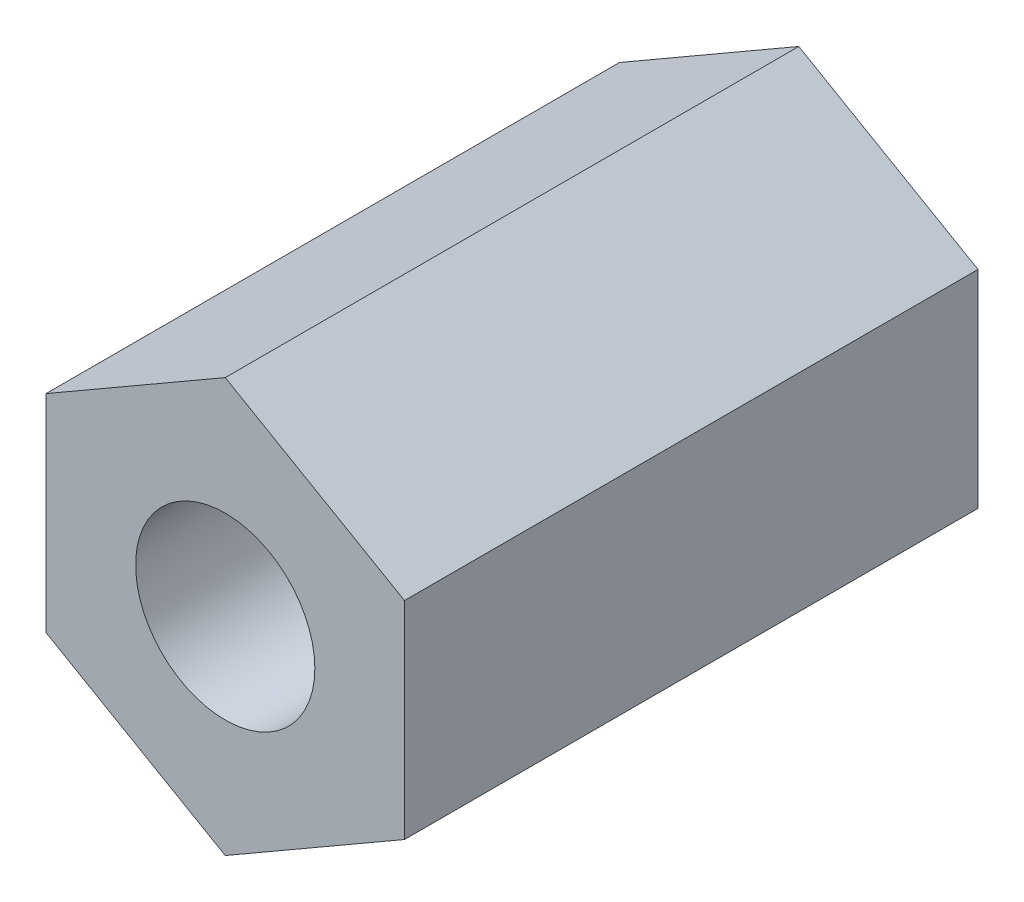
ISO-10303-21;
HEADER;
FILE_DESCRIPTION(('STEP AP214'),'2;1');
FILE_NAME('part.step','',(''),(''),'','','');
FILE_SCHEMA(('AUTOMOTIVE_DESIGN { 1 0 10303 214 1 1 1 1 }'));
ENDSEC;
DATA;
#1=APPLICATION_CONTEXT('core data for automotive mechanical design processes');
#2=APPLICATION_PROTOCOL_DEFINITION('international standard','automotive_design',2000,#1);
#3=PRODUCT_CONTEXT('',#1,'mechanical');
#4=PRODUCT('Part','Part','',(#3));
#5=PRODUCT_RELATED_PRODUCT_CATEGORY('part','',(#4));
#6=PRODUCT_DEFINITION_FORMATION('','',#4);
#7=PRODUCT_DEFINITION_CONTEXT('part definition',#1,'design');
#8=PRODUCT_DEFINITION('design','',#6,#7);
#9=PRODUCT_DEFINITION_SHAPE('','',#8);
#10=(LENGTH_UNIT() NAMED_UNIT(*) SI_UNIT(.MILLI.,.METRE.));
#11=(NAMED_UNIT(*) PLANE_ANGLE_UNIT() SI_UNIT($,.RADIAN.));
#12=(NAMED_UNIT(*) SI_UNIT($,.STERADIAN.) SOLID_ANGLE_UNIT());
#13=UNCERTAINTY_MEASURE_WITH_UNIT(LENGTH_MEASURE(1.E-05),#10,'distance_accuracy_value','');
#14=(GEOMETRIC_REPRESENTATION_CONTEXT(3) GLOBAL_UNCERTAINTY_ASSIGNED_CONTEXT((#13)) GLOBAL_UNIT_ASSIGNED_CONTEXT((#10,
#11,#12)) REPRESENTATION_CONTEXT('',''));
#15=CARTESIAN_POINT('',(0.,0.,0.));
#16=DIRECTION('',(0.,0.,1.));
#17=DIRECTION('',(1.,0.,0.));
#18=AXIS2_PLACEMENT_3D('',#15,#16,#17);
#19=CARTESIAN_POINT('',(0.,-2.88675134594813,8.));
#20=DIRECTION('',(-0.5,0.866025403784439,0.));
#21=DIRECTION('',(-0.866025403784439,-0.5,0.));
#22=AXIS2_PLACEMENT_3D('',#19,#20,#21);
#23=PLANE('',#22);
#24=DIRECTION('',(0.866025403784439,0.5,0.));
#25=VECTOR('',#24,1.);
#26=CARTESIAN_POINT('',(0.,-2.88675134594813,0.));
#27=LINE('',#26,#25);
#28=CARTESIAN_POINT('',(0.,-2.88675134594813,0.));
#29=VERTEX_POINT('',#28);
#30=CARTESIAN_POINT('',(2.5,-1.44337567297407,0.));
#31=VERTEX_POINT('',#30);
#32=EDGE_CURVE('E116',#29,#31,#27,.T.);
#33=ORIENTED_EDGE('',*,*,#32,.T.);
#34=DIRECTION('',(0.,0.,-1.));
#35=VECTOR('',#34,1.);
#36=CARTESIAN_POINT('',(2.5,-1.44337567297407,8.));
#37=LINE('',#36,#35);
#38=CARTESIAN_POINT('',(2.5,-1.44337567297407,8.));
#39=VERTEX_POINT('',#38);
#40=EDGE_CURVE('E11',#39,#31,#37,.T.);
#41=ORIENTED_EDGE('',*,*,#40,.F.);
#42=DIRECTION('',(0.866025403784439,0.5,0.));
#43=VECTOR('',#42,1.);
#44=CARTESIAN_POINT('',(0.,-2.88675134594813,8.));
#45=LINE('',#44,#43);
#46=CARTESIAN_POINT('',(0.,-2.88675134594813,8.));
#47=VERTEX_POINT('',#46);
#48=EDGE_CURVE('E127',#47,#39,#45,.T.);
#49=ORIENTED_EDGE('',*,*,#48,.F.);
#50=DIRECTION('',(0.,0.,-1.));
#51=VECTOR('',#50,1.);
#52=CARTESIAN_POINT('',(0.,-2.88675134594813,8.));
#53=LINE('',#52,#51);
#54=EDGE_CURVE('E112',#47,#29,#53,.T.);
#55=ORIENTED_EDGE('',*,*,#54,.T.);
#56=EDGE_LOOP('',(#33,#41,#49,#55));
#57=FACE_BOUND('',#56,.T.);
#58=ADVANCED_FACE('F32',(#57),#23,.F.);
#59=CARTESIAN_POINT('',(2.5,-1.44337567297407,8.));
#60=DIRECTION('',(-1.,0.,0.));
#61=DIRECTION('',(0.,-1.,0.));
#62=AXIS2_PLACEMENT_3D('',#59,#60,#61);
#63=PLANE('',#62);
#64=DIRECTION('',(0.,1.,0.));
#65=VECTOR('',#64,1.);
#66=CARTESIAN_POINT('',(2.5,-1.44337567297407,0.));
#67=LINE('',#66,#65);
#68=CARTESIAN_POINT('',(2.5,1.44337567297407,0.));
#69=VERTEX_POINT('',#68);
#70=EDGE_CURVE('E119',#31,#69,#67,.T.);
#71=ORIENTED_EDGE('',*,*,#70,.T.);
#72=DIRECTION('',(0.,0.,-1.));
#73=VECTOR('',#72,1.);
#74=CARTESIAN_POINT('',(2.5,1.44337567297407,8.));
#75=LINE('',#74,#73);
#76=CARTESIAN_POINT('',(2.5,1.44337567297407,8.));
#77=VERTEX_POINT('',#76);
#78=EDGE_CURVE('E40',#77,#69,#75,.T.);
#79=ORIENTED_EDGE('',*,*,#78,.F.);
#80=DIRECTION('',(0.,1.,0.));
#81=VECTOR('',#80,1.);
#82=CARTESIAN_POINT('',(2.5,-1.44337567297407,8.));
#83=LINE('',#82,#81);
#84=EDGE_CURVE('E85',#39,#77,#83,.T.);
#85=ORIENTED_EDGE('',*,*,#84,.F.);
#86=ORIENTED_EDGE('',*,*,#40,.T.);
#87=EDGE_LOOP('',(#71,#79,#85,#86));
#88=FACE_BOUND('',#87,.T.);
#89=ADVANCED_FACE('F152',(#88),#63,.F.);
#90=CARTESIAN_POINT('',(2.5,1.44337567297407,8.));
#91=DIRECTION('',(-0.5,-0.866025403784439,0.));
#92=DIRECTION('',(0.866025403784439,-0.5,0.));
#93=AXIS2_PLACEMENT_3D('',#90,#91,#92);
#94=PLANE('',#93);
#95=DIRECTION('',(-0.866025403784439,0.5,0.));
#96=VECTOR('',#95,1.);
#97=CARTESIAN_POINT('',(2.5,1.44337567297407,0.));
#98=LINE('',#97,#96);
#99=CARTESIAN_POINT('',(0.,2.88675134594813,0.));
#100=VERTEX_POINT('',#99);
#101=EDGE_CURVE('E122',#69,#100,#98,.T.);
#102=ORIENTED_EDGE('',*,*,#101,.T.);
#103=DIRECTION('',(0.,0.,-1.));
#104=VECTOR('',#103,1.);
#105=CARTESIAN_POINT('',(0.,2.88675134594813,8.));
#106=LINE('',#105,#104);
#107=CARTESIAN_POINT('',(0.,2.88675134594813,8.));
#108=VERTEX_POINT('',#107);
#109=EDGE_CURVE('E107',#108,#100,#106,.T.);
#110=ORIENTED_EDGE('',*,*,#109,.F.);
#111=DIRECTION('',(-0.866025403784439,0.5,0.));
#112=VECTOR('',#111,1.);
#113=CARTESIAN_POINT('',(2.5,1.44337567297407,8.));
#114=LINE('',#113,#112);
#115=EDGE_CURVE('E98',#77,#108,#114,.T.);
#116=ORIENTED_EDGE('',*,*,#115,.F.);
#117=ORIENTED_EDGE('',*,*,#78,.T.);
#118=EDGE_LOOP('',(#102,#110,#116,#117));
#119=FACE_BOUND('',#118,.T.);
#120=ADVANCED_FACE('F133',(#119),#94,.F.);
#121=CARTESIAN_POINT('',(0.,2.88675134594813,8.));
#122=DIRECTION('',(0.5,-0.866025403784439,0.));
#123=DIRECTION('',(0.866025403784439,0.5,0.));
#124=AXIS2_PLACEMENT_3D('',#121,#122,#123);
#125=PLANE('',#124);
#126=DIRECTION('',(-0.866025403784439,-0.5,0.));
#127=VECTOR('',#126,1.);
#128=CARTESIAN_POINT('',(0.,2.88675134594813,0.));
#129=LINE('',#128,#127);
#130=CARTESIAN_POINT('',(-2.5,1.44337567297407,0.));
#131=VERTEX_POINT('',#130);
#132=EDGE_CURVE('E106',#100,#131,#129,.T.);
#133=ORIENTED_EDGE('',*,*,#132,.T.);
#134=DIRECTION('',(0.,0.,-1.));
#135=VECTOR('',#134,1.);
#136=CARTESIAN_POINT('',(-2.5,1.44337567297407,8.));
#137=LINE('',#136,#135);
#138=CARTESIAN_POINT('',(-2.5,1.44337567297407,8.));
#139=VERTEX_POINT('',#138);
#140=EDGE_CURVE('E103',#139,#131,#137,.T.);
#141=ORIENTED_EDGE('',*,*,#140,.F.);
#142=DIRECTION('',(-0.866025403784439,-0.5,0.));
#143=VECTOR('',#142,1.);
#144=CARTESIAN_POINT('',(0.,2.88675134594813,8.));
#145=LINE('',#144,#143);
#146=EDGE_CURVE('E92',#108,#139,#145,.T.);
#147=ORIENTED_EDGE('',*,*,#146,.F.);
#148=ORIENTED_EDGE('',*,*,#109,.T.);
#149=EDGE_LOOP('',(#133,#141,#147,#148));
#150=FACE_BOUND('',#149,.T.);
#151=ADVANCED_FACE('F104',(#150),#125,.F.);
#152=CARTESIAN_POINT('',(-2.5,1.44337567297407,8.));
#153=DIRECTION('',(1.,0.,0.));
#154=DIRECTION('',(0.,0.,-1.));
#155=AXIS2_PLACEMENT_3D('',#152,#153,#154);
#156=PLANE('',#155);
#157=DIRECTION('',(0.,-1.,0.));
#158=VECTOR('',#157,1.);
#159=CARTESIAN_POINT('',(-2.5,1.44337567297407,0.));
#160=LINE('',#159,#158);
#161=CARTESIAN_POINT('',(-2.5,-1.44337567297406,0.));
#162=VERTEX_POINT('',#161);
#163=EDGE_CURVE('E71',#131,#162,#160,.T.);
#164=ORIENTED_EDGE('',*,*,#163,.T.);
#165=DIRECTION('',(0.,0.,-1.));
#166=VECTOR('',#165,1.);
#167=CARTESIAN_POINT('',(-2.5,-1.44337567297406,8.));
#168=LINE('',#167,#166);
#169=CARTESIAN_POINT('',(-2.5,-1.44337567297406,8.));
#170=VERTEX_POINT('',#169);
#171=EDGE_CURVE('E108',#170,#162,#168,.T.);
#172=ORIENTED_EDGE('',*,*,#171,.F.);
#173=DIRECTION('',(0.,-1.,0.));
#174=VECTOR('',#173,1.);
#175=CARTESIAN_POINT('',(-2.5,1.44337567297407,8.));
#176=LINE('',#175,#174);
#177=EDGE_CURVE('E96',#139,#170,#176,.T.);
#178=ORIENTED_EDGE('',*,*,#177,.F.);
#179=ORIENTED_EDGE('',*,*,#140,.T.);
#180=EDGE_LOOP('',(#164,#172,#178,#179));
#181=FACE_BOUND('',#180,.T.);
#182=ADVANCED_FACE('F110',(#181),#156,.F.);
#183=CARTESIAN_POINT('',(-2.5,-1.44337567297406,8.));
#184=DIRECTION('',(0.5,0.866025403784439,0.));
#185=DIRECTION('',(-0.866025403784439,0.5,0.));
#186=AXIS2_PLACEMENT_3D('',#183,#184,#185);
#187=PLANE('',#186);
#188=DIRECTION('',(0.866025403784439,-0.5,0.));
#189=VECTOR('',#188,1.);
#190=CARTESIAN_POINT('',(-2.5,-1.44337567297406,0.));
#191=LINE('',#190,#189);
#192=EDGE_CURVE('E77',#162,#29,#191,.T.);
#193=ORIENTED_EDGE('',*,*,#192,.T.);
#194=ORIENTED_EDGE('',*,*,#54,.F.);
#195=DIRECTION('',(0.866025403784439,-0.5,0.));
#196=VECTOR('',#195,1.);
#197=CARTESIAN_POINT('',(-2.5,-1.44337567297406,8.));
#198=LINE('',#197,#196);
#199=EDGE_CURVE('E48',#170,#47,#198,.T.);
#200=ORIENTED_EDGE('',*,*,#199,.F.);
#201=ORIENTED_EDGE('',*,*,#171,.T.);
#202=EDGE_LOOP('',(#193,#194,#200,#201));
#203=FACE_BOUND('',#202,.T.);
#204=ADVANCED_FACE('F140',(#203),#187,.F.);
#205=CARTESIAN_POINT('',(0.,0.,8.));
#206=DIRECTION('',(0.,0.,1.));
#207=DIRECTION('',(1.,0.,0.));
#208=AXIS2_PLACEMENT_3D('',#205,#206,#207);
#209=PLANE('',#208);
#210=CARTESIAN_POINT('',(0.,0.,8.));
#211=DIRECTION('',(0.,0.,1.));
#212=DIRECTION('',(1.,0.,0.));
#213=AXIS2_PLACEMENT_3D('',#210,#211,#212);
#214=CIRCLE('',#213,1.24999999999999);
#215=CARTESIAN_POINT('',(1.24999999999999,0.,8.));
#216=VERTEX_POINT('',#215);
#217=EDGE_CURVE('E207',#216,#216,#214,.T.);
#218=ORIENTED_EDGE('',*,*,#217,.F.);
#219=EDGE_LOOP('',(#218));
#220=FACE_BOUND('',#219,.T.);
#221=ORIENTED_EDGE('',*,*,#48,.T.);
#222=ORIENTED_EDGE('',*,*,#84,.T.);
#223=ORIENTED_EDGE('',*,*,#115,.T.);
#224=ORIENTED_EDGE('',*,*,#146,.T.);
#225=ORIENTED_EDGE('',*,*,#177,.T.);
#226=ORIENTED_EDGE('',*,*,#199,.T.);
#227=EDGE_LOOP('',(#221,#222,#223,#224,#225,#226));
#228=FACE_BOUND('',#227,.T.);
#229=ADVANCED_FACE('F94',(#220,#228),#209,.T.);
#230=CARTESIAN_POINT('',(0.,0.,0.));
#231=DIRECTION('',(0.,0.,1.));
#232=DIRECTION('',(1.,0.,0.));
#233=AXIS2_PLACEMENT_3D('',#230,#231,#232);
#234=PLANE('',#233);
#235=CARTESIAN_POINT('',(0.,0.,0.));
#236=DIRECTION('',(0.,0.,1.));
#237=DIRECTION('',(1.,0.,0.));
#238=AXIS2_PLACEMENT_3D('',#235,#236,#237);
#239=CIRCLE('',#238,1.24999999999999);
#240=CARTESIAN_POINT('',(1.24999999999999,0.,0.));
#241=VERTEX_POINT('',#240);
#242=EDGE_CURVE('E120',#241,#241,#239,.T.);
#243=ORIENTED_EDGE('',*,*,#242,.T.);
#244=EDGE_LOOP('',(#243));
#245=FACE_BOUND('',#244,.T.);
#246=ORIENTED_EDGE('',*,*,#32,.F.);
#247=ORIENTED_EDGE('',*,*,#192,.F.);
#248=ORIENTED_EDGE('',*,*,#163,.F.);
#249=ORIENTED_EDGE('',*,*,#132,.F.);
#250=ORIENTED_EDGE('',*,*,#101,.F.);
#251=ORIENTED_EDGE('',*,*,#70,.F.);
#252=EDGE_LOOP('',(#246,#247,#248,#249,#250,#251));
#253=FACE_BOUND('',#252,.T.);
#254=ADVANCED_FACE('F136',(#245,#253),#234,.F.);
#255=CARTESIAN_POINT('',(0.,0.,8.));
#256=DIRECTION('',(0.,0.,1.));
#257=DIRECTION('',(1.,0.,0.));
#258=AXIS2_PLACEMENT_3D('',#255,#256,#257);
#259=CYLINDRICAL_SURFACE('',#258,1.24999999999999);
#260=ORIENTED_EDGE('',*,*,#242,.F.);
#261=EDGE_LOOP('',(#260));
#262=FACE_BOUND('',#261,.T.);
#263=ORIENTED_EDGE('',*,*,#217,.T.);
#264=EDGE_LOOP('',(#263));
#265=FACE_BOUND('',#264,.T.);
#266=ADVANCED_FACE('F189',(#262,#265),#259,.F.);
#267=CLOSED_SHELL('',(#58,#89,#120,#151,#182,#204,#229,#254,#266));
#268=MANIFOLD_SOLID_BREP('B2',#267);
#269=ADVANCED_BREP_SHAPE_REPRESENTATION('',(#18,#268),#14);
#270=SHAPE_DEFINITION_REPRESENTATION(#9,#269);
ENDSEC;
END-ISO-10303-21;
